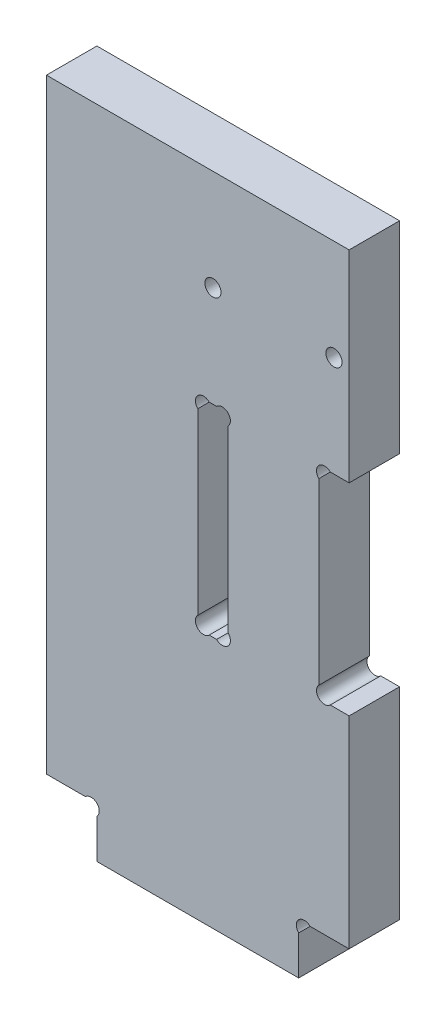
ISO-10303-21;
HEADER;
FILE_DESCRIPTION(('STEP AP214'),'2;1');
FILE_NAME('part.step','',(''),(''),'','','');
FILE_SCHEMA(('AUTOMOTIVE_DESIGN { 1 0 10303 214 1 1 1 1 }'));
ENDSEC;
DATA;
#1=APPLICATION_CONTEXT('core data for automotive mechanical design processes');
#2=APPLICATION_PROTOCOL_DEFINITION('international standard','automotive_design',2000,#1);
#3=PRODUCT_CONTEXT('',#1,'mechanical');
#4=PRODUCT('Part','Part','',(#3));
#5=PRODUCT_RELATED_PRODUCT_CATEGORY('part','',(#4));
#6=PRODUCT_DEFINITION_FORMATION('','',#4);
#7=PRODUCT_DEFINITION_CONTEXT('part definition',#1,'design');
#8=PRODUCT_DEFINITION('design','',#6,#7);
#9=PRODUCT_DEFINITION_SHAPE('','',#8);
#10=(LENGTH_UNIT() NAMED_UNIT(*) SI_UNIT(.MILLI.,.METRE.));
#11=(NAMED_UNIT(*) PLANE_ANGLE_UNIT() SI_UNIT($,.RADIAN.));
#12=(NAMED_UNIT(*) SI_UNIT($,.STERADIAN.) SOLID_ANGLE_UNIT());
#13=UNCERTAINTY_MEASURE_WITH_UNIT(LENGTH_MEASURE(1.E-05),#10,'distance_accuracy_value','');
#14=(GEOMETRIC_REPRESENTATION_CONTEXT(3) GLOBAL_UNCERTAINTY_ASSIGNED_CONTEXT((#13)) GLOBAL_UNIT_ASSIGNED_CONTEXT((#10,
#11,#12)) REPRESENTATION_CONTEXT('',''));
#15=CARTESIAN_POINT('',(0.,0.,0.));
#16=DIRECTION('',(0.,0.,1.));
#17=DIRECTION('',(1.,0.,0.));
#18=AXIS2_PLACEMENT_3D('',#15,#16,#17);
#19=CARTESIAN_POINT('',(278.868629150101,8.86862915010152,10.));
#20=DIRECTION('',(0.,0.,1.));
#21=DIRECTION('',(1.,0.,0.));
#22=AXIS2_PLACEMENT_3D('',#19,#20,#21);
#23=PLANE('',#22);
#24=CARTESIAN_POINT('',(327.,110.,10.));
#25=DIRECTION('',(0.,0.,1.));
#26=DIRECTION('',(-1.,0.,0.));
#27=AXIS2_PLACEMENT_3D('',#24,#25,#26);
#28=CIRCLE('',#27,1.59999999999996);
#29=CARTESIAN_POINT('',(325.4,110.,10.));
#30=VERTEX_POINT('',#29);
#31=EDGE_CURVE('E212',#30,#30,#28,.T.);
#32=ORIENTED_EDGE('',*,*,#31,.F.);
#33=EDGE_LOOP('',(#32));
#34=FACE_BOUND('',#33,.T.);
#35=DIRECTION('',(0.,1.,0.));
#36=VECTOR('',#35,1.);
#37=CARTESIAN_POINT('',(330.,90.0000000000001,10.));
#38=LINE('',#37,#36);
#39=CARTESIAN_POINT('',(330.,90.0000000000001,10.));
#40=VERTEX_POINT('',#39);
#41=CARTESIAN_POINT('',(330.,130.,10.));
#42=VERTEX_POINT('',#41);
#43=EDGE_CURVE('E291',#40,#42,#38,.T.);
#44=ORIENTED_EDGE('',*,*,#43,.T.);
#45=DIRECTION('',(-1.,0.,0.));
#46=VECTOR('',#45,1.);
#47=CARTESIAN_POINT('',(330.,130.,10.));
#48=LINE('',#47,#46);
#49=CARTESIAN_POINT('',(270.,130.,10.));
#50=VERTEX_POINT('',#49);
#51=EDGE_CURVE('E294',#42,#50,#48,.T.);
#52=ORIENTED_EDGE('',*,*,#51,.T.);
#53=DIRECTION('',(0.,-1.,0.));
#54=VECTOR('',#53,1.);
#55=CARTESIAN_POINT('',(270.,130.,10.));
#56=LINE('',#55,#54);
#57=CARTESIAN_POINT('',(270.,9.99999999999999,10.));
#58=VERTEX_POINT('',#57);
#59=EDGE_CURVE('E296',#50,#58,#56,.T.);
#60=ORIENTED_EDGE('',*,*,#59,.T.);
#61=DIRECTION('',(1.,0.,0.));
#62=VECTOR('',#61,1.);
#63=CARTESIAN_POINT('',(270.,9.99999999999999,10.));
#64=LINE('',#63,#62);
#65=CARTESIAN_POINT('',(277.737258300203,10.,10.));
#66=VERTEX_POINT('',#65);
#67=EDGE_CURVE('E298',#58,#66,#64,.T.);
#68=ORIENTED_EDGE('',*,*,#67,.T.);
#69=CARTESIAN_POINT('',(278.868629150101,8.86862915010152,10.));
#70=DIRECTION('',(0.,0.,-1.));
#71=DIRECTION('',(1.,0.,0.));
#72=AXIS2_PLACEMENT_3D('',#69,#70,#71);
#73=CIRCLE('',#72,1.59999999999998);
#74=CARTESIAN_POINT('',(280.,7.73725830020305,10.));
#75=VERTEX_POINT('',#74);
#76=EDGE_CURVE('E300',#66,#75,#73,.T.);
#77=ORIENTED_EDGE('',*,*,#76,.T.);
#78=DIRECTION('',(0.,-1.,0.));
#79=VECTOR('',#78,1.);
#80=CARTESIAN_POINT('',(280.,7.73725830020305,10.));
#81=LINE('',#80,#79);
#82=CARTESIAN_POINT('',(280.,0.,10.));
#83=VERTEX_POINT('',#82);
#84=EDGE_CURVE('E302',#75,#83,#81,.T.);
#85=ORIENTED_EDGE('',*,*,#84,.T.);
#86=DIRECTION('',(1.,0.,0.));
#87=VECTOR('',#86,1.);
#88=CARTESIAN_POINT('',(320.,0.,10.));
#89=LINE('',#88,#87);
#90=CARTESIAN_POINT('',(320.,0.,10.));
#91=VERTEX_POINT('',#90);
#92=EDGE_CURVE('E304',#83,#91,#89,.T.);
#93=ORIENTED_EDGE('',*,*,#92,.T.);
#94=DIRECTION('',(0.,1.,0.));
#95=VECTOR('',#94,1.);
#96=CARTESIAN_POINT('',(320.,7.73725830020305,10.));
#97=LINE('',#96,#95);
#98=CARTESIAN_POINT('',(320.,7.73725830020306,10.));
#99=VERTEX_POINT('',#98);
#100=EDGE_CURVE('E306',#91,#99,#97,.T.);
#101=ORIENTED_EDGE('',*,*,#100,.T.);
#102=CARTESIAN_POINT('',(321.131370849899,8.86862915010152,10.));
#103=DIRECTION('',(0.,0.,-1.));
#104=DIRECTION('',(-1.,0.,0.));
#105=AXIS2_PLACEMENT_3D('',#102,#103,#104);
#106=CIRCLE('',#105,1.6);
#107=CARTESIAN_POINT('',(322.262741699797,10.,10.));
#108=VERTEX_POINT('',#107);
#109=EDGE_CURVE('E308',#99,#108,#106,.T.);
#110=ORIENTED_EDGE('',*,*,#109,.T.);
#111=DIRECTION('',(1.,0.,0.));
#112=VECTOR('',#111,1.);
#113=CARTESIAN_POINT('',(322.262741699797,10.,10.));
#114=LINE('',#113,#112);
#115=CARTESIAN_POINT('',(330.,10.,10.));
#116=VERTEX_POINT('',#115);
#117=EDGE_CURVE('E310',#108,#116,#114,.T.);
#118=ORIENTED_EDGE('',*,*,#117,.T.);
#119=DIRECTION('',(0.,1.,0.));
#120=VECTOR('',#119,1.);
#121=CARTESIAN_POINT('',(330.,10.,10.));
#122=LINE('',#121,#120);
#123=CARTESIAN_POINT('',(330.,50.,10.));
#124=VERTEX_POINT('',#123);
#125=EDGE_CURVE('E312',#116,#124,#122,.T.);
#126=ORIENTED_EDGE('',*,*,#125,.T.);
#127=DIRECTION('',(-1.,0.,0.));
#128=VECTOR('',#127,1.);
#129=CARTESIAN_POINT('',(326.262741699797,50.,10.));
#130=LINE('',#129,#128);
#131=CARTESIAN_POINT('',(326.262741699797,50.,10.));
#132=VERTEX_POINT('',#131);
#133=EDGE_CURVE('E314',#124,#132,#130,.T.);
#134=ORIENTED_EDGE('',*,*,#133,.T.);
#135=CARTESIAN_POINT('',(325.131370849898,51.1313708498985,10.));
#136=DIRECTION('',(0.,0.,-1.));
#137=DIRECTION('',(-1.,0.,0.));
#138=AXIS2_PLACEMENT_3D('',#135,#136,#137);
#139=CIRCLE('',#138,1.59999999999995);
#140=CARTESIAN_POINT('',(324.,52.2627416997971,10.));
#141=VERTEX_POINT('',#140);
#142=EDGE_CURVE('E316',#132,#141,#139,.T.);
#143=ORIENTED_EDGE('',*,*,#142,.T.);
#144=DIRECTION('',(0.,1.,0.));
#145=VECTOR('',#144,1.);
#146=CARTESIAN_POINT('',(324.,87.7372583002031,10.));
#147=LINE('',#146,#145);
#148=CARTESIAN_POINT('',(324.,87.7372583002031,10.));
#149=VERTEX_POINT('',#148);
#150=EDGE_CURVE('E318',#141,#149,#147,.T.);
#151=ORIENTED_EDGE('',*,*,#150,.T.);
#152=CARTESIAN_POINT('',(325.131370849898,88.8686291501016,10.));
#153=DIRECTION('',(0.,0.,-1.));
#154=DIRECTION('',(1.,0.,0.));
#155=AXIS2_PLACEMENT_3D('',#152,#153,#154);
#156=CIRCLE('',#155,1.59999999999996);
#157=CARTESIAN_POINT('',(326.262741699797,90.0000000000001,10.));
#158=VERTEX_POINT('',#157);
#159=EDGE_CURVE('E320',#149,#158,#156,.T.);
#160=ORIENTED_EDGE('',*,*,#159,.T.);
#161=DIRECTION('',(1.,0.,0.));
#162=VECTOR('',#161,1.);
#163=CARTESIAN_POINT('',(326.262741699797,90.0000000000001,10.));
#164=LINE('',#163,#162);
#165=EDGE_CURVE('E322',#158,#40,#164,.T.);
#166=ORIENTED_EDGE('',*,*,#165,.T.);
#167=EDGE_LOOP('',(#44,#52,#60,#68,#77,#85,#93,#101,#110,#118,#126,#134,#143,#151,#160,#166));
#168=FACE_BOUND('',#167,.T.);
#169=DIRECTION('',(0.,1.,0.));
#170=VECTOR('',#169,1.);
#171=CARTESIAN_POINT('',(306.,52.2627416997969,10.));
#172=LINE('',#171,#170);
#173=CARTESIAN_POINT('',(306.,52.2627416997969,10.));
#174=VERTEX_POINT('',#173);
#175=CARTESIAN_POINT('',(306.,87.7372583002031,10.));
#176=VERTEX_POINT('',#175);
#177=EDGE_CURVE('E233',#174,#176,#172,.T.);
#178=ORIENTED_EDGE('',*,*,#177,.F.);
#179=CARTESIAN_POINT('',(304.868629150102,51.1313708498985,10.));
#180=DIRECTION('',(0.,0.,1.));
#181=DIRECTION('',(1.,0.,0.));
#182=AXIS2_PLACEMENT_3D('',#179,#180,#181);
#183=CIRCLE('',#182,1.59999999999995);
#184=CARTESIAN_POINT('',(303.737258300203,50.,10.));
#185=VERTEX_POINT('',#184);
#186=EDGE_CURVE('E204',#185,#174,#183,.T.);
#187=ORIENTED_EDGE('',*,*,#186,.F.);
#188=DIRECTION('',(1.,0.,0.));
#189=VECTOR('',#188,1.);
#190=CARTESIAN_POINT('',(302.262741699797,50.,10.));
#191=LINE('',#190,#189);
#192=CARTESIAN_POINT('',(302.262741699797,50.,10.));
#193=VERTEX_POINT('',#192);
#194=EDGE_CURVE('E245',#193,#185,#191,.T.);
#195=ORIENTED_EDGE('',*,*,#194,.F.);
#196=CARTESIAN_POINT('',(301.131370849898,51.1313708498985,10.));
#197=DIRECTION('',(0.,0.,1.));
#198=DIRECTION('',(-1.,0.,0.));
#199=AXIS2_PLACEMENT_3D('',#196,#197,#198);
#200=CIRCLE('',#199,1.59999999999997);
#201=CARTESIAN_POINT('',(300.,52.262741699797,10.));
#202=VERTEX_POINT('',#201);
#203=EDGE_CURVE('E243',#202,#193,#200,.T.);
#204=ORIENTED_EDGE('',*,*,#203,.F.);
#205=DIRECTION('',(0.,-1.,0.));
#206=VECTOR('',#205,1.);
#207=CARTESIAN_POINT('',(300.,87.7372583002031,10.));
#208=LINE('',#207,#206);
#209=CARTESIAN_POINT('',(300.,87.7372583002031,10.));
#210=VERTEX_POINT('',#209);
#211=EDGE_CURVE('E241',#210,#202,#208,.T.);
#212=ORIENTED_EDGE('',*,*,#211,.F.);
#213=CARTESIAN_POINT('',(301.131370849898,88.8686291501016,10.));
#214=DIRECTION('',(0.,0.,1.));
#215=DIRECTION('',(1.,0.,0.));
#216=AXIS2_PLACEMENT_3D('',#213,#214,#215);
#217=CIRCLE('',#216,1.59999999999995);
#218=CARTESIAN_POINT('',(302.262741699797,90.0000000000001,10.));
#219=VERTEX_POINT('',#218);
#220=EDGE_CURVE('E239',#219,#210,#217,.T.);
#221=ORIENTED_EDGE('',*,*,#220,.F.);
#222=DIRECTION('',(-1.,0.,0.));
#223=VECTOR('',#222,1.);
#224=CARTESIAN_POINT('',(302.262741699797,90.0000000000001,10.));
#225=LINE('',#224,#223);
#226=CARTESIAN_POINT('',(303.737258300203,90.0000000000001,10.));
#227=VERTEX_POINT('',#226);
#228=EDGE_CURVE('E237',#227,#219,#225,.T.);
#229=ORIENTED_EDGE('',*,*,#228,.F.);
#230=CARTESIAN_POINT('',(304.868629150102,88.8686291501016,10.));
#231=DIRECTION('',(0.,0.,1.));
#232=DIRECTION('',(-1.,0.,0.));
#233=AXIS2_PLACEMENT_3D('',#230,#231,#232);
#234=CIRCLE('',#233,1.59999999999997);
#235=EDGE_CURVE('E235',#176,#227,#234,.T.);
#236=ORIENTED_EDGE('',*,*,#235,.F.);
#237=EDGE_LOOP('',(#178,#187,#195,#204,#212,#221,#229,#236));
#238=FACE_BOUND('',#237,.T.);
#239=CARTESIAN_POINT('',(303.,110.,10.));
#240=DIRECTION('',(0.,0.,1.));
#241=DIRECTION('',(1.,0.,0.));
#242=AXIS2_PLACEMENT_3D('',#239,#240,#241);
#243=CIRCLE('',#242,1.59999999999996);
#244=CARTESIAN_POINT('',(304.6,110.,10.));
#245=VERTEX_POINT('',#244);
#246=EDGE_CURVE('E597',#245,#245,#243,.T.);
#247=ORIENTED_EDGE('',*,*,#246,.F.);
#248=EDGE_LOOP('',(#247));
#249=FACE_BOUND('',#248,.T.);
#250=ADVANCED_FACE('F28',(#34,#168,#238,#249),#23,.T.);
#251=CARTESIAN_POINT('',(278.868629150101,8.86862915010152,0.));
#252=DIRECTION('',(0.,0.,1.));
#253=DIRECTION('',(1.,0.,0.));
#254=AXIS2_PLACEMENT_3D('',#251,#252,#253);
#255=PLANE('',#254);
#256=CARTESIAN_POINT('',(327.,110.,0.));
#257=DIRECTION('',(0.,0.,1.));
#258=DIRECTION('',(-1.,0.,0.));
#259=AXIS2_PLACEMENT_3D('',#256,#257,#258);
#260=CIRCLE('',#259,1.59999999999996);
#261=CARTESIAN_POINT('',(325.4,110.,0.));
#262=VERTEX_POINT('',#261);
#263=EDGE_CURVE('E215',#262,#262,#260,.T.);
#264=ORIENTED_EDGE('',*,*,#263,.T.);
#265=EDGE_LOOP('',(#264));
#266=FACE_BOUND('',#265,.T.);
#267=DIRECTION('',(0.,1.,0.));
#268=VECTOR('',#267,1.);
#269=CARTESIAN_POINT('',(330.,90.0000000000001,0.));
#270=LINE('',#269,#268);
#271=CARTESIAN_POINT('',(330.,90.0000000000001,0.));
#272=VERTEX_POINT('',#271);
#273=CARTESIAN_POINT('',(330.,130.,0.));
#274=VERTEX_POINT('',#273);
#275=EDGE_CURVE('E205',#272,#274,#270,.T.);
#276=ORIENTED_EDGE('',*,*,#275,.F.);
#277=DIRECTION('',(1.,0.,0.));
#278=VECTOR('',#277,1.);
#279=CARTESIAN_POINT('',(326.262741699797,90.0000000000001,0.));
#280=LINE('',#279,#278);
#281=CARTESIAN_POINT('',(326.262741699797,90.0000000000001,0.));
#282=VERTEX_POINT('',#281);
#283=EDGE_CURVE('E289',#282,#272,#280,.T.);
#284=ORIENTED_EDGE('',*,*,#283,.F.);
#285=CARTESIAN_POINT('',(325.131370849898,88.8686291501016,0.));
#286=DIRECTION('',(0.,0.,-1.));
#287=DIRECTION('',(1.,0.,0.));
#288=AXIS2_PLACEMENT_3D('',#285,#286,#287);
#289=CIRCLE('',#288,1.59999999999996);
#290=CARTESIAN_POINT('',(324.,87.7372583002031,0.));
#291=VERTEX_POINT('',#290);
#292=EDGE_CURVE('E287',#291,#282,#289,.T.);
#293=ORIENTED_EDGE('',*,*,#292,.F.);
#294=DIRECTION('',(0.,1.,0.));
#295=VECTOR('',#294,1.);
#296=CARTESIAN_POINT('',(324.,87.7372583002031,0.));
#297=LINE('',#296,#295);
#298=CARTESIAN_POINT('',(324.,52.2627416997971,0.));
#299=VERTEX_POINT('',#298);
#300=EDGE_CURVE('E285',#299,#291,#297,.T.);
#301=ORIENTED_EDGE('',*,*,#300,.F.);
#302=CARTESIAN_POINT('',(325.131370849898,51.1313708498985,0.));
#303=DIRECTION('',(0.,0.,-1.));
#304=DIRECTION('',(-1.,0.,0.));
#305=AXIS2_PLACEMENT_3D('',#302,#303,#304);
#306=CIRCLE('',#305,1.59999999999995);
#307=CARTESIAN_POINT('',(326.262741699797,50.,0.));
#308=VERTEX_POINT('',#307);
#309=EDGE_CURVE('E283',#308,#299,#306,.T.);
#310=ORIENTED_EDGE('',*,*,#309,.F.);
#311=DIRECTION('',(-1.,0.,0.));
#312=VECTOR('',#311,1.);
#313=CARTESIAN_POINT('',(326.262741699797,50.,0.));
#314=LINE('',#313,#312);
#315=CARTESIAN_POINT('',(330.,50.,0.));
#316=VERTEX_POINT('',#315);
#317=EDGE_CURVE('E281',#316,#308,#314,.T.);
#318=ORIENTED_EDGE('',*,*,#317,.F.);
#319=DIRECTION('',(0.,1.,0.));
#320=VECTOR('',#319,1.);
#321=CARTESIAN_POINT('',(330.,10.,0.));
#322=LINE('',#321,#320);
#323=CARTESIAN_POINT('',(330.,10.,0.));
#324=VERTEX_POINT('',#323);
#325=EDGE_CURVE('E279',#324,#316,#322,.T.);
#326=ORIENTED_EDGE('',*,*,#325,.F.);
#327=DIRECTION('',(1.,0.,0.));
#328=VECTOR('',#327,1.);
#329=CARTESIAN_POINT('',(322.262741699797,10.,0.));
#330=LINE('',#329,#328);
#331=CARTESIAN_POINT('',(322.262741699797,10.,0.));
#332=VERTEX_POINT('',#331);
#333=EDGE_CURVE('E277',#332,#324,#330,.T.);
#334=ORIENTED_EDGE('',*,*,#333,.F.);
#335=CARTESIAN_POINT('',(321.131370849899,8.86862915010152,0.));
#336=DIRECTION('',(0.,0.,-1.));
#337=DIRECTION('',(-1.,0.,0.));
#338=AXIS2_PLACEMENT_3D('',#335,#336,#337);
#339=CIRCLE('',#338,1.6);
#340=CARTESIAN_POINT('',(320.,7.73725830020306,0.));
#341=VERTEX_POINT('',#340);
#342=EDGE_CURVE('E275',#341,#332,#339,.T.);
#343=ORIENTED_EDGE('',*,*,#342,.F.);
#344=DIRECTION('',(0.,1.,0.));
#345=VECTOR('',#344,1.);
#346=CARTESIAN_POINT('',(320.,7.73725830020305,0.));
#347=LINE('',#346,#345);
#348=CARTESIAN_POINT('',(320.,0.,0.));
#349=VERTEX_POINT('',#348);
#350=EDGE_CURVE('E273',#349,#341,#347,.T.);
#351=ORIENTED_EDGE('',*,*,#350,.F.);
#352=DIRECTION('',(1.,0.,0.));
#353=VECTOR('',#352,1.);
#354=CARTESIAN_POINT('',(320.,0.,0.));
#355=LINE('',#354,#353);
#356=CARTESIAN_POINT('',(280.,0.,0.));
#357=VERTEX_POINT('',#356);
#358=EDGE_CURVE('E271',#357,#349,#355,.T.);
#359=ORIENTED_EDGE('',*,*,#358,.F.);
#360=DIRECTION('',(0.,-1.,0.));
#361=VECTOR('',#360,1.);
#362=CARTESIAN_POINT('',(280.,7.73725830020305,0.));
#363=LINE('',#362,#361);
#364=CARTESIAN_POINT('',(280.,7.73725830020305,0.));
#365=VERTEX_POINT('',#364);
#366=EDGE_CURVE('E269',#365,#357,#363,.T.);
#367=ORIENTED_EDGE('',*,*,#366,.F.);
#368=CARTESIAN_POINT('',(278.868629150101,8.86862915010152,0.));
#369=DIRECTION('',(0.,0.,-1.));
#370=DIRECTION('',(1.,0.,0.));
#371=AXIS2_PLACEMENT_3D('',#368,#369,#370);
#372=CIRCLE('',#371,1.59999999999998);
#373=CARTESIAN_POINT('',(277.737258300203,10.,0.));
#374=VERTEX_POINT('',#373);
#375=EDGE_CURVE('E267',#374,#365,#372,.T.);
#376=ORIENTED_EDGE('',*,*,#375,.F.);
#377=DIRECTION('',(1.,0.,0.));
#378=VECTOR('',#377,1.);
#379=CARTESIAN_POINT('',(270.,9.99999999999999,0.));
#380=LINE('',#379,#378);
#381=CARTESIAN_POINT('',(270.,9.99999999999999,0.));
#382=VERTEX_POINT('',#381);
#383=EDGE_CURVE('E265',#382,#374,#380,.T.);
#384=ORIENTED_EDGE('',*,*,#383,.F.);
#385=DIRECTION('',(0.,-1.,0.));
#386=VECTOR('',#385,1.);
#387=CARTESIAN_POINT('',(270.,130.,0.));
#388=LINE('',#387,#386);
#389=CARTESIAN_POINT('',(270.,130.,0.));
#390=VERTEX_POINT('',#389);
#391=EDGE_CURVE('E263',#390,#382,#388,.T.);
#392=ORIENTED_EDGE('',*,*,#391,.F.);
#393=DIRECTION('',(-1.,0.,0.));
#394=VECTOR('',#393,1.);
#395=CARTESIAN_POINT('',(330.,130.,0.));
#396=LINE('',#395,#394);
#397=EDGE_CURVE('E261',#274,#390,#396,.T.);
#398=ORIENTED_EDGE('',*,*,#397,.F.);
#399=EDGE_LOOP('',(#276,#284,#293,#301,#310,#318,#326,#334,#343,#351,#359,#367,#376,#384,#392,#398));
#400=FACE_BOUND('',#399,.T.);
#401=CARTESIAN_POINT('',(304.868629150102,51.1313708498985,0.));
#402=DIRECTION('',(0.,0.,1.));
#403=DIRECTION('',(1.,0.,0.));
#404=AXIS2_PLACEMENT_3D('',#401,#402,#403);
#405=CIRCLE('',#404,1.59999999999995);
#406=CARTESIAN_POINT('',(303.737258300203,50.,0.));
#407=VERTEX_POINT('',#406);
#408=CARTESIAN_POINT('',(306.,52.2627416997969,0.));
#409=VERTEX_POINT('',#408);
#410=EDGE_CURVE('E51',#407,#409,#405,.T.);
#411=ORIENTED_EDGE('',*,*,#410,.T.);
#412=DIRECTION('',(0.,1.,0.));
#413=VECTOR('',#412,1.);
#414=CARTESIAN_POINT('',(306.,52.2627416997969,0.));
#415=LINE('',#414,#413);
#416=CARTESIAN_POINT('',(306.,87.7372583002031,0.));
#417=VERTEX_POINT('',#416);
#418=EDGE_CURVE('E191',#409,#417,#415,.T.);
#419=ORIENTED_EDGE('',*,*,#418,.T.);
#420=CARTESIAN_POINT('',(304.868629150102,88.8686291501016,0.));
#421=DIRECTION('',(0.,0.,1.));
#422=DIRECTION('',(-1.,0.,0.));
#423=AXIS2_PLACEMENT_3D('',#420,#421,#422);
#424=CIRCLE('',#423,1.59999999999997);
#425=CARTESIAN_POINT('',(303.737258300203,90.0000000000001,0.));
#426=VERTEX_POINT('',#425);
#427=EDGE_CURVE('E200',#417,#426,#424,.T.);
#428=ORIENTED_EDGE('',*,*,#427,.T.);
#429=DIRECTION('',(-1.,0.,0.));
#430=VECTOR('',#429,1.);
#431=CARTESIAN_POINT('',(302.262741699797,90.0000000000001,0.));
#432=LINE('',#431,#430);
#433=CARTESIAN_POINT('',(302.262741699797,90.0000000000001,0.));
#434=VERTEX_POINT('',#433);
#435=EDGE_CURVE('E220',#426,#434,#432,.T.);
#436=ORIENTED_EDGE('',*,*,#435,.T.);
#437=CARTESIAN_POINT('',(301.131370849898,88.8686291501016,0.));
#438=DIRECTION('',(0.,0.,1.));
#439=DIRECTION('',(1.,0.,0.));
#440=AXIS2_PLACEMENT_3D('',#437,#438,#439);
#441=CIRCLE('',#440,1.59999999999995);
#442=CARTESIAN_POINT('',(300.,87.7372583002031,0.));
#443=VERTEX_POINT('',#442);
#444=EDGE_CURVE('E223',#434,#443,#441,.T.);
#445=ORIENTED_EDGE('',*,*,#444,.T.);
#446=DIRECTION('',(0.,-1.,0.));
#447=VECTOR('',#446,1.);
#448=CARTESIAN_POINT('',(300.,87.7372583002031,0.));
#449=LINE('',#448,#447);
#450=CARTESIAN_POINT('',(300.,52.262741699797,0.));
#451=VERTEX_POINT('',#450);
#452=EDGE_CURVE('E226',#443,#451,#449,.T.);
#453=ORIENTED_EDGE('',*,*,#452,.T.);
#454=CARTESIAN_POINT('',(301.131370849898,51.1313708498985,0.));
#455=DIRECTION('',(0.,0.,1.));
#456=DIRECTION('',(-1.,0.,0.));
#457=AXIS2_PLACEMENT_3D('',#454,#455,#456);
#458=CIRCLE('',#457,1.59999999999997);
#459=CARTESIAN_POINT('',(302.262741699797,50.0000000000001,0.));
#460=VERTEX_POINT('',#459);
#461=EDGE_CURVE('E229',#451,#460,#458,.T.);
#462=ORIENTED_EDGE('',*,*,#461,.T.);
#463=DIRECTION('',(1.,0.,0.));
#464=VECTOR('',#463,1.);
#465=CARTESIAN_POINT('',(302.262741699797,50.,0.));
#466=LINE('',#465,#464);
#467=EDGE_CURVE('E211',#460,#407,#466,.T.);
#468=ORIENTED_EDGE('',*,*,#467,.T.);
#469=EDGE_LOOP('',(#411,#419,#428,#436,#445,#453,#462,#468));
#470=FACE_BOUND('',#469,.T.);
#471=CARTESIAN_POINT('',(303.,110.,0.));
#472=DIRECTION('',(0.,0.,1.));
#473=DIRECTION('',(1.,0.,0.));
#474=AXIS2_PLACEMENT_3D('',#471,#472,#473);
#475=CIRCLE('',#474,1.59999999999996);
#476=CARTESIAN_POINT('',(304.6,110.,0.));
#477=VERTEX_POINT('',#476);
#478=EDGE_CURVE('E600',#477,#477,#475,.T.);
#479=ORIENTED_EDGE('',*,*,#478,.T.);
#480=EDGE_LOOP('',(#479));
#481=FACE_BOUND('',#480,.T.);
#482=ADVANCED_FACE('F208',(#266,#400,#470,#481),#255,.F.);
#483=CARTESIAN_POINT('',(330.,90.0000000000001,10.));
#484=DIRECTION('',(-1.,0.,0.));
#485=DIRECTION('',(0.,-1.,0.));
#486=AXIS2_PLACEMENT_3D('',#483,#484,#485);
#487=PLANE('',#486);
#488=ORIENTED_EDGE('',*,*,#275,.T.);
#489=DIRECTION('',(0.,0.,-1.));
#490=VECTOR('',#489,1.);
#491=CARTESIAN_POINT('',(330.,130.,10.));
#492=LINE('',#491,#490);
#493=EDGE_CURVE('E11',#42,#274,#492,.T.);
#494=ORIENTED_EDGE('',*,*,#493,.F.);
#495=ORIENTED_EDGE('',*,*,#43,.F.);
#496=DIRECTION('',(0.,0.,-1.));
#497=VECTOR('',#496,1.);
#498=CARTESIAN_POINT('',(330.,90.0000000000001,10.));
#499=LINE('',#498,#497);
#500=EDGE_CURVE('E324',#40,#272,#499,.T.);
#501=ORIENTED_EDGE('',*,*,#500,.T.);
#502=EDGE_LOOP('',(#488,#494,#495,#501));
#503=FACE_BOUND('',#502,.T.);
#504=ADVANCED_FACE('F30',(#503),#487,.F.);
#505=CARTESIAN_POINT('',(330.,130.,10.));
#506=DIRECTION('',(0.,-1.,0.));
#507=DIRECTION('',(0.,0.,-1.));
#508=AXIS2_PLACEMENT_3D('',#505,#506,#507);
#509=PLANE('',#508);
#510=ORIENTED_EDGE('',*,*,#397,.T.);
#511=DIRECTION('',(0.,0.,-1.));
#512=VECTOR('',#511,1.);
#513=CARTESIAN_POINT('',(270.,130.,10.));
#514=LINE('',#513,#512);
#515=EDGE_CURVE('E36',#50,#390,#514,.T.);
#516=ORIENTED_EDGE('',*,*,#515,.F.);
#517=ORIENTED_EDGE('',*,*,#51,.F.);
#518=ORIENTED_EDGE('',*,*,#493,.T.);
#519=EDGE_LOOP('',(#510,#516,#517,#518));
#520=FACE_BOUND('',#519,.T.);
#521=ADVANCED_FACE('F392',(#520),#509,.F.);
#522=CARTESIAN_POINT('',(270.,130.,10.));
#523=DIRECTION('',(1.,0.,0.));
#524=DIRECTION('',(0.,0.,-1.));
#525=AXIS2_PLACEMENT_3D('',#522,#523,#524);
#526=PLANE('',#525);
#527=ORIENTED_EDGE('',*,*,#391,.T.);
#528=DIRECTION('',(0.,0.,-1.));
#529=VECTOR('',#528,1.);
#530=CARTESIAN_POINT('',(270.,9.99999999999999,10.));
#531=LINE('',#530,#529);
#532=EDGE_CURVE('E363',#58,#382,#531,.T.);
#533=ORIENTED_EDGE('',*,*,#532,.F.);
#534=ORIENTED_EDGE('',*,*,#59,.F.);
#535=ORIENTED_EDGE('',*,*,#515,.T.);
#536=EDGE_LOOP('',(#527,#533,#534,#535));
#537=FACE_BOUND('',#536,.T.);
#538=ADVANCED_FACE('F370',(#537),#526,.F.);
#539=CARTESIAN_POINT('',(270.,9.99999999999999,10.));
#540=DIRECTION('',(0.,1.,0.));
#541=DIRECTION('',(-1.,0.,0.));
#542=AXIS2_PLACEMENT_3D('',#539,#540,#541);
#543=PLANE('',#542);
#544=ORIENTED_EDGE('',*,*,#383,.T.);
#545=DIRECTION('',(0.,0.,-1.));
#546=VECTOR('',#545,1.);
#547=CARTESIAN_POINT('',(277.737258300203,10.,10.));
#548=LINE('',#547,#546);
#549=EDGE_CURVE('E360',#66,#374,#548,.T.);
#550=ORIENTED_EDGE('',*,*,#549,.F.);
#551=ORIENTED_EDGE('',*,*,#67,.F.);
#552=ORIENTED_EDGE('',*,*,#532,.T.);
#553=EDGE_LOOP('',(#544,#550,#551,#552));
#554=FACE_BOUND('',#553,.T.);
#555=ADVANCED_FACE('F380',(#554),#543,.F.);
#556=CARTESIAN_POINT('',(278.868629150101,8.86862915010152,10.));
#557=DIRECTION('',(0.,0.,-1.));
#558=DIRECTION('',(-1.,0.,0.));
#559=AXIS2_PLACEMENT_3D('',#556,#557,#558);
#560=CYLINDRICAL_SURFACE('',#559,1.59999999999998);
#561=ORIENTED_EDGE('',*,*,#375,.T.);
#562=DIRECTION('',(0.,0.,-1.));
#563=VECTOR('',#562,1.);
#564=CARTESIAN_POINT('',(280.,7.73725830020305,10.));
#565=LINE('',#564,#563);
#566=EDGE_CURVE('E357',#75,#365,#565,.T.);
#567=ORIENTED_EDGE('',*,*,#566,.F.);
#568=ORIENTED_EDGE('',*,*,#76,.F.);
#569=ORIENTED_EDGE('',*,*,#549,.T.);
#570=EDGE_LOOP('',(#561,#567,#568,#569));
#571=FACE_BOUND('',#570,.T.);
#572=ADVANCED_FACE('F384',(#571),#560,.F.);
#573=CARTESIAN_POINT('',(280.,7.73725830020305,10.));
#574=DIRECTION('',(1.,0.,0.));
#575=DIRECTION('',(0.,0.,-1.));
#576=AXIS2_PLACEMENT_3D('',#573,#574,#575);
#577=PLANE('',#576);
#578=ORIENTED_EDGE('',*,*,#366,.T.);
#579=DIRECTION('',(0.,0.,-1.));
#580=VECTOR('',#579,1.);
#581=CARTESIAN_POINT('',(280.,0.,10.));
#582=LINE('',#581,#580);
#583=EDGE_CURVE('E354',#83,#357,#582,.T.);
#584=ORIENTED_EDGE('',*,*,#583,.F.);
#585=ORIENTED_EDGE('',*,*,#84,.F.);
#586=ORIENTED_EDGE('',*,*,#566,.T.);
#587=EDGE_LOOP('',(#578,#584,#585,#586));
#588=FACE_BOUND('',#587,.T.);
#589=ADVANCED_FACE('F445',(#588),#577,.F.);
#590=CARTESIAN_POINT('',(320.,0.,10.));
#591=DIRECTION('',(0.,1.,0.));
#592=DIRECTION('',(-1.,0.,0.));
#593=AXIS2_PLACEMENT_3D('',#590,#591,#592);
#594=PLANE('',#593);
#595=ORIENTED_EDGE('',*,*,#358,.T.);
#596=DIRECTION('',(0.,0.,-1.));
#597=VECTOR('',#596,1.);
#598=CARTESIAN_POINT('',(320.,0.,10.));
#599=LINE('',#598,#597);
#600=EDGE_CURVE('E351',#91,#349,#599,.T.);
#601=ORIENTED_EDGE('',*,*,#600,.F.);
#602=ORIENTED_EDGE('',*,*,#92,.F.);
#603=ORIENTED_EDGE('',*,*,#583,.T.);
#604=EDGE_LOOP('',(#595,#601,#602,#603));
#605=FACE_BOUND('',#604,.T.);
#606=ADVANCED_FACE('F442',(#605),#594,.F.);
#607=CARTESIAN_POINT('',(320.,7.73725830020305,10.));
#608=DIRECTION('',(-1.,0.,0.));
#609=DIRECTION('',(0.,0.,1.));
#610=AXIS2_PLACEMENT_3D('',#607,#608,#609);
#611=PLANE('',#610);
#612=ORIENTED_EDGE('',*,*,#350,.T.);
#613=DIRECTION('',(0.,0.,-1.));
#614=VECTOR('',#613,1.);
#615=CARTESIAN_POINT('',(320.,7.73725830020306,10.));
#616=LINE('',#615,#614);
#617=EDGE_CURVE('E348',#99,#341,#616,.T.);
#618=ORIENTED_EDGE('',*,*,#617,.F.);
#619=ORIENTED_EDGE('',*,*,#100,.F.);
#620=ORIENTED_EDGE('',*,*,#600,.T.);
#621=EDGE_LOOP('',(#612,#618,#619,#620));
#622=FACE_BOUND('',#621,.T.);
#623=ADVANCED_FACE('F438',(#622),#611,.F.);
#624=CARTESIAN_POINT('',(321.131370849899,8.86862915010152,10.));
#625=DIRECTION('',(0.,0.,-1.));
#626=DIRECTION('',(-1.,0.,0.));
#627=AXIS2_PLACEMENT_3D('',#624,#625,#626);
#628=CYLINDRICAL_SURFACE('',#627,1.6);
#629=ORIENTED_EDGE('',*,*,#342,.T.);
#630=DIRECTION('',(0.,0.,-1.));
#631=VECTOR('',#630,1.);
#632=CARTESIAN_POINT('',(322.262741699797,10.,10.));
#633=LINE('',#632,#631);
#634=EDGE_CURVE('E345',#108,#332,#633,.T.);
#635=ORIENTED_EDGE('',*,*,#634,.F.);
#636=ORIENTED_EDGE('',*,*,#109,.F.);
#637=ORIENTED_EDGE('',*,*,#617,.T.);
#638=EDGE_LOOP('',(#629,#635,#636,#637));
#639=FACE_BOUND('',#638,.T.);
#640=ADVANCED_FACE('F434',(#639),#628,.F.);
#641=CARTESIAN_POINT('',(322.262741699797,10.,10.));
#642=DIRECTION('',(0.,1.,0.));
#643=DIRECTION('',(-1.,0.,0.));
#644=AXIS2_PLACEMENT_3D('',#641,#642,#643);
#645=PLANE('',#644);
#646=ORIENTED_EDGE('',*,*,#333,.T.);
#647=DIRECTION('',(0.,0.,-1.));
#648=VECTOR('',#647,1.);
#649=CARTESIAN_POINT('',(330.,10.,10.));
#650=LINE('',#649,#648);
#651=EDGE_CURVE('E342',#116,#324,#650,.T.);
#652=ORIENTED_EDGE('',*,*,#651,.F.);
#653=ORIENTED_EDGE('',*,*,#117,.F.);
#654=ORIENTED_EDGE('',*,*,#634,.T.);
#655=EDGE_LOOP('',(#646,#652,#653,#654));
#656=FACE_BOUND('',#655,.T.);
#657=ADVANCED_FACE('F429',(#656),#645,.F.);
#658=CARTESIAN_POINT('',(330.,10.,10.));
#659=DIRECTION('',(-1.,0.,0.));
#660=DIRECTION('',(0.,-1.,0.));
#661=AXIS2_PLACEMENT_3D('',#658,#659,#660);
#662=PLANE('',#661);
#663=ORIENTED_EDGE('',*,*,#325,.T.);
#664=DIRECTION('',(0.,0.,-1.));
#665=VECTOR('',#664,1.);
#666=CARTESIAN_POINT('',(330.,50.,10.));
#667=LINE('',#666,#665);
#668=EDGE_CURVE('E339',#124,#316,#667,.T.);
#669=ORIENTED_EDGE('',*,*,#668,.F.);
#670=ORIENTED_EDGE('',*,*,#125,.F.);
#671=ORIENTED_EDGE('',*,*,#651,.T.);
#672=EDGE_LOOP('',(#663,#669,#670,#671));
#673=FACE_BOUND('',#672,.T.);
#674=ADVANCED_FACE('F423',(#673),#662,.F.);
#675=CARTESIAN_POINT('',(326.262741699797,50.,10.));
#676=DIRECTION('',(0.,-1.,0.));
#677=DIRECTION('',(1.,0.,0.));
#678=AXIS2_PLACEMENT_3D('',#675,#676,#677);
#679=PLANE('',#678);
#680=ORIENTED_EDGE('',*,*,#317,.T.);
#681=DIRECTION('',(0.,0.,-1.));
#682=VECTOR('',#681,1.);
#683=CARTESIAN_POINT('',(326.262741699797,50.,10.));
#684=LINE('',#683,#682);
#685=EDGE_CURVE('E336',#132,#308,#684,.T.);
#686=ORIENTED_EDGE('',*,*,#685,.F.);
#687=ORIENTED_EDGE('',*,*,#133,.F.);
#688=ORIENTED_EDGE('',*,*,#668,.T.);
#689=EDGE_LOOP('',(#680,#686,#687,#688));
#690=FACE_BOUND('',#689,.T.);
#691=ADVANCED_FACE('F419',(#690),#679,.F.);
#692=CARTESIAN_POINT('',(325.131370849898,51.1313708498985,10.));
#693=DIRECTION('',(0.,0.,-1.));
#694=DIRECTION('',(-1.,0.,0.));
#695=AXIS2_PLACEMENT_3D('',#692,#693,#694);
#696=CYLINDRICAL_SURFACE('',#695,1.59999999999995);
#697=ORIENTED_EDGE('',*,*,#309,.T.);
#698=DIRECTION('',(0.,0.,-1.));
#699=VECTOR('',#698,1.);
#700=CARTESIAN_POINT('',(324.,52.2627416997971,10.));
#701=LINE('',#700,#699);
#702=EDGE_CURVE('E333',#141,#299,#701,.T.);
#703=ORIENTED_EDGE('',*,*,#702,.F.);
#704=ORIENTED_EDGE('',*,*,#142,.F.);
#705=ORIENTED_EDGE('',*,*,#685,.T.);
#706=EDGE_LOOP('',(#697,#703,#704,#705));
#707=FACE_BOUND('',#706,.T.);
#708=ADVANCED_FACE('F414',(#707),#696,.F.);
#709=CARTESIAN_POINT('',(324.,87.7372583002031,10.));
#710=DIRECTION('',(-1.,0.,0.));
#711=DIRECTION('',(0.,0.,1.));
#712=AXIS2_PLACEMENT_3D('',#709,#710,#711);
#713=PLANE('',#712);
#714=ORIENTED_EDGE('',*,*,#300,.T.);
#715=DIRECTION('',(0.,0.,-1.));
#716=VECTOR('',#715,1.);
#717=CARTESIAN_POINT('',(324.,87.7372583002031,10.));
#718=LINE('',#717,#716);
#719=EDGE_CURVE('E330',#149,#291,#718,.T.);
#720=ORIENTED_EDGE('',*,*,#719,.F.);
#721=ORIENTED_EDGE('',*,*,#150,.F.);
#722=ORIENTED_EDGE('',*,*,#702,.T.);
#723=EDGE_LOOP('',(#714,#720,#721,#722));
#724=FACE_BOUND('',#723,.T.);
#725=ADVANCED_FACE('F408',(#724),#713,.F.);
#726=CARTESIAN_POINT('',(325.131370849898,88.8686291501016,10.));
#727=DIRECTION('',(0.,0.,-1.));
#728=DIRECTION('',(-1.,0.,0.));
#729=AXIS2_PLACEMENT_3D('',#726,#727,#728);
#730=CYLINDRICAL_SURFACE('',#729,1.59999999999996);
#731=ORIENTED_EDGE('',*,*,#292,.T.);
#732=DIRECTION('',(0.,0.,-1.));
#733=VECTOR('',#732,1.);
#734=CARTESIAN_POINT('',(326.262741699797,90.0000000000001,10.));
#735=LINE('',#734,#733);
#736=EDGE_CURVE('E327',#158,#282,#735,.T.);
#737=ORIENTED_EDGE('',*,*,#736,.F.);
#738=ORIENTED_EDGE('',*,*,#159,.F.);
#739=ORIENTED_EDGE('',*,*,#719,.T.);
#740=EDGE_LOOP('',(#731,#737,#738,#739));
#741=FACE_BOUND('',#740,.T.);
#742=ADVANCED_FACE('F404',(#741),#730,.F.);
#743=CARTESIAN_POINT('',(326.262741699797,90.0000000000001,10.));
#744=DIRECTION('',(0.,1.,0.));
#745=DIRECTION('',(0.,0.,1.));
#746=AXIS2_PLACEMENT_3D('',#743,#744,#745);
#747=PLANE('',#746);
#748=ORIENTED_EDGE('',*,*,#283,.T.);
#749=ORIENTED_EDGE('',*,*,#500,.F.);
#750=ORIENTED_EDGE('',*,*,#165,.F.);
#751=ORIENTED_EDGE('',*,*,#736,.T.);
#752=EDGE_LOOP('',(#748,#749,#750,#751));
#753=FACE_BOUND('',#752,.T.);
#754=ADVANCED_FACE('F399',(#753),#747,.F.);
#755=CARTESIAN_POINT('',(304.868629150102,51.1313708498985,10.));
#756=DIRECTION('',(0.,0.,-1.));
#757=DIRECTION('',(-1.,0.,0.));
#758=AXIS2_PLACEMENT_3D('',#755,#756,#757);
#759=CYLINDRICAL_SURFACE('',#758,1.59999999999995);
#760=ORIENTED_EDGE('',*,*,#410,.F.);
#761=DIRECTION('',(0.,0.,-1.));
#762=VECTOR('',#761,1.);
#763=CARTESIAN_POINT('',(303.737258300203,50.,10.));
#764=LINE('',#763,#762);
#765=EDGE_CURVE('E247',#185,#407,#764,.T.);
#766=ORIENTED_EDGE('',*,*,#765,.F.);
#767=ORIENTED_EDGE('',*,*,#186,.T.);
#768=DIRECTION('',(0.,0.,-1.));
#769=VECTOR('',#768,1.);
#770=CARTESIAN_POINT('',(306.,52.2627416997969,10.));
#771=LINE('',#770,#769);
#772=EDGE_CURVE('E193',#174,#409,#771,.T.);
#773=ORIENTED_EDGE('',*,*,#772,.T.);
#774=EDGE_LOOP('',(#760,#766,#767,#773));
#775=FACE_BOUND('',#774,.T.);
#776=ADVANCED_FACE('F202',(#775),#759,.F.);
#777=CARTESIAN_POINT('',(306.,52.2627416997969,10.));
#778=DIRECTION('',(-1.,0.,0.));
#779=DIRECTION('',(0.,0.,1.));
#780=AXIS2_PLACEMENT_3D('',#777,#778,#779);
#781=PLANE('',#780);
#782=ORIENTED_EDGE('',*,*,#418,.F.);
#783=ORIENTED_EDGE('',*,*,#772,.F.);
#784=ORIENTED_EDGE('',*,*,#177,.T.);
#785=DIRECTION('',(0.,0.,-1.));
#786=VECTOR('',#785,1.);
#787=CARTESIAN_POINT('',(306.,87.7372583002031,10.));
#788=LINE('',#787,#786);
#789=EDGE_CURVE('E196',#176,#417,#788,.T.);
#790=ORIENTED_EDGE('',*,*,#789,.T.);
#791=EDGE_LOOP('',(#782,#783,#784,#790));
#792=FACE_BOUND('',#791,.T.);
#793=ADVANCED_FACE('F192',(#792),#781,.T.);
#794=CARTESIAN_POINT('',(304.868629150102,88.8686291501016,10.));
#795=DIRECTION('',(0.,0.,-1.));
#796=DIRECTION('',(-1.,0.,0.));
#797=AXIS2_PLACEMENT_3D('',#794,#795,#796);
#798=CYLINDRICAL_SURFACE('',#797,1.59999999999997);
#799=ORIENTED_EDGE('',*,*,#427,.F.);
#800=ORIENTED_EDGE('',*,*,#789,.F.);
#801=ORIENTED_EDGE('',*,*,#235,.T.);
#802=DIRECTION('',(0.,0.,-1.));
#803=VECTOR('',#802,1.);
#804=CARTESIAN_POINT('',(303.737258300203,90.0000000000001,10.));
#805=LINE('',#804,#803);
#806=EDGE_CURVE('E256',#227,#426,#805,.T.);
#807=ORIENTED_EDGE('',*,*,#806,.T.);
#808=EDGE_LOOP('',(#799,#800,#801,#807));
#809=FACE_BOUND('',#808,.T.);
#810=ADVANCED_FACE('F529',(#809),#798,.F.);
#811=CARTESIAN_POINT('',(302.262741699797,90.0000000000001,10.));
#812=DIRECTION('',(0.,-1.,0.));
#813=DIRECTION('',(1.,0.,0.));
#814=AXIS2_PLACEMENT_3D('',#811,#812,#813);
#815=PLANE('',#814);
#816=ORIENTED_EDGE('',*,*,#435,.F.);
#817=ORIENTED_EDGE('',*,*,#806,.F.);
#818=ORIENTED_EDGE('',*,*,#228,.T.);
#819=DIRECTION('',(0.,0.,-1.));
#820=VECTOR('',#819,1.);
#821=CARTESIAN_POINT('',(302.262741699797,90.0000000000001,10.));
#822=LINE('',#821,#820);
#823=EDGE_CURVE('E254',#219,#434,#822,.T.);
#824=ORIENTED_EDGE('',*,*,#823,.T.);
#825=EDGE_LOOP('',(#816,#817,#818,#824));
#826=FACE_BOUND('',#825,.T.);
#827=ADVANCED_FACE('F536',(#826),#815,.T.);
#828=CARTESIAN_POINT('',(301.131370849898,88.8686291501016,10.));
#829=DIRECTION('',(0.,0.,-1.));
#830=DIRECTION('',(-1.,0.,0.));
#831=AXIS2_PLACEMENT_3D('',#828,#829,#830);
#832=CYLINDRICAL_SURFACE('',#831,1.59999999999995);
#833=ORIENTED_EDGE('',*,*,#444,.F.);
#834=ORIENTED_EDGE('',*,*,#823,.F.);
#835=ORIENTED_EDGE('',*,*,#220,.T.);
#836=DIRECTION('',(0.,0.,-1.));
#837=VECTOR('',#836,1.);
#838=CARTESIAN_POINT('',(300.,87.7372583002031,10.));
#839=LINE('',#838,#837);
#840=EDGE_CURVE('E252',#210,#443,#839,.T.);
#841=ORIENTED_EDGE('',*,*,#840,.T.);
#842=EDGE_LOOP('',(#833,#834,#835,#841));
#843=FACE_BOUND('',#842,.T.);
#844=ADVANCED_FACE('F544',(#843),#832,.F.);
#845=CARTESIAN_POINT('',(300.,87.7372583002031,10.));
#846=DIRECTION('',(1.,0.,0.));
#847=DIRECTION('',(0.,0.,-1.));
#848=AXIS2_PLACEMENT_3D('',#845,#846,#847);
#849=PLANE('',#848);
#850=ORIENTED_EDGE('',*,*,#452,.F.);
#851=ORIENTED_EDGE('',*,*,#840,.F.);
#852=ORIENTED_EDGE('',*,*,#211,.T.);
#853=DIRECTION('',(0.,0.,-1.));
#854=VECTOR('',#853,1.);
#855=CARTESIAN_POINT('',(300.,52.262741699797,10.));
#856=LINE('',#855,#854);
#857=EDGE_CURVE('E250',#202,#451,#856,.T.);
#858=ORIENTED_EDGE('',*,*,#857,.T.);
#859=EDGE_LOOP('',(#850,#851,#852,#858));
#860=FACE_BOUND('',#859,.T.);
#861=ADVANCED_FACE('F552',(#860),#849,.T.);
#862=CARTESIAN_POINT('',(301.131370849898,51.1313708498985,10.));
#863=DIRECTION('',(0.,0.,-1.));
#864=DIRECTION('',(-1.,0.,0.));
#865=AXIS2_PLACEMENT_3D('',#862,#863,#864);
#866=CYLINDRICAL_SURFACE('',#865,1.59999999999997);
#867=ORIENTED_EDGE('',*,*,#461,.F.);
#868=ORIENTED_EDGE('',*,*,#857,.F.);
#869=ORIENTED_EDGE('',*,*,#203,.T.);
#870=DIRECTION('',(0.,0.,-1.));
#871=VECTOR('',#870,1.);
#872=CARTESIAN_POINT('',(302.262741699797,50.0000000000001,10.));
#873=LINE('',#872,#871);
#874=EDGE_CURVE('E43',#193,#460,#873,.T.);
#875=ORIENTED_EDGE('',*,*,#874,.T.);
#876=EDGE_LOOP('',(#867,#868,#869,#875));
#877=FACE_BOUND('',#876,.T.);
#878=ADVANCED_FACE('F560',(#877),#866,.F.);
#879=CARTESIAN_POINT('',(302.262741699797,50.,10.));
#880=DIRECTION('',(0.,1.,0.));
#881=DIRECTION('',(-1.,0.,0.));
#882=AXIS2_PLACEMENT_3D('',#879,#880,#881);
#883=PLANE('',#882);
#884=ORIENTED_EDGE('',*,*,#467,.F.);
#885=ORIENTED_EDGE('',*,*,#874,.F.);
#886=ORIENTED_EDGE('',*,*,#194,.T.);
#887=ORIENTED_EDGE('',*,*,#765,.T.);
#888=EDGE_LOOP('',(#884,#885,#886,#887));
#889=FACE_BOUND('',#888,.T.);
#890=ADVANCED_FACE('F568',(#889),#883,.T.);
#891=CARTESIAN_POINT('',(327.,110.,10.));
#892=DIRECTION('',(0.,0.,-1.));
#893=DIRECTION('',(-1.,0.,0.));
#894=AXIS2_PLACEMENT_3D('',#891,#892,#893);
#895=CYLINDRICAL_SURFACE('',#894,1.59999999999996);
#896=ORIENTED_EDGE('',*,*,#31,.T.);
#897=EDGE_LOOP('',(#896));
#898=FACE_BOUND('',#897,.T.);
#899=ORIENTED_EDGE('',*,*,#263,.F.);
#900=EDGE_LOOP('',(#899));
#901=FACE_BOUND('',#900,.T.);
#902=ADVANCED_FACE('F576',(#898,#901),#895,.F.);
#903=CARTESIAN_POINT('',(303.,110.,10.));
#904=DIRECTION('',(0.,0.,-1.));
#905=DIRECTION('',(-1.,0.,0.));
#906=AXIS2_PLACEMENT_3D('',#903,#904,#905);
#907=CYLINDRICAL_SURFACE('',#906,1.59999999999996);
#908=ORIENTED_EDGE('',*,*,#246,.T.);
#909=EDGE_LOOP('',(#908));
#910=FACE_BOUND('',#909,.T.);
#911=ORIENTED_EDGE('',*,*,#478,.F.);
#912=EDGE_LOOP('',(#911));
#913=FACE_BOUND('',#912,.T.);
#914=ADVANCED_FACE('F583',(#910,#913),#907,.F.);
#915=CLOSED_SHELL('',(#250,#482,#504,#521,#538,#555,#572,#589,#606,#623,#640,#657,#674,#691,
#708,#725,#742,#754,#776,#793,#810,#827,#844,#861,#878,#890,#902,#914));
#916=MANIFOLD_SOLID_BREP('B2',#915);
#917=ADVANCED_BREP_SHAPE_REPRESENTATION('',(#18,#916),#14);
#918=SHAPE_DEFINITION_REPRESENTATION(#9,#917);
ENDSEC;
END-ISO-10303-21;
